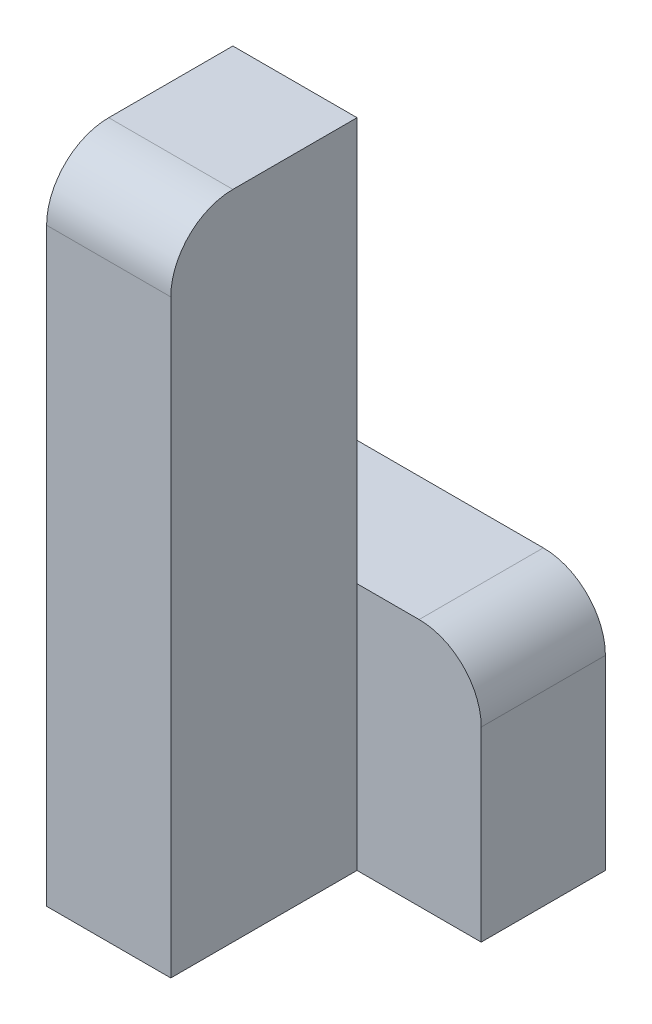
ISO-10303-21;
HEADER;
FILE_DESCRIPTION(('STEP AP214'),'2;1');
FILE_NAME('part.step','',(''),(''),'','','');
FILE_SCHEMA(('AUTOMOTIVE_DESIGN { 1 0 10303 214 1 1 1 1 }'));
ENDSEC;
DATA;
#1=APPLICATION_CONTEXT('core data for automotive mechanical design processes');
#2=APPLICATION_PROTOCOL_DEFINITION('international standard','automotive_design',2000,#1);
#3=PRODUCT_CONTEXT('',#1,'mechanical');
#4=PRODUCT('Part','Part','',(#3));
#5=PRODUCT_RELATED_PRODUCT_CATEGORY('part','',(#4));
#6=PRODUCT_DEFINITION_FORMATION('','',#4);
#7=PRODUCT_DEFINITION_CONTEXT('part definition',#1,'design');
#8=PRODUCT_DEFINITION('design','',#6,#7);
#9=PRODUCT_DEFINITION_SHAPE('','',#8);
#10=(LENGTH_UNIT() NAMED_UNIT(*) SI_UNIT(.MILLI.,.METRE.));
#11=(NAMED_UNIT(*) PLANE_ANGLE_UNIT() SI_UNIT($,.RADIAN.));
#12=(NAMED_UNIT(*) SI_UNIT($,.STERADIAN.) SOLID_ANGLE_UNIT());
#13=UNCERTAINTY_MEASURE_WITH_UNIT(LENGTH_MEASURE(1.E-05),#10,'distance_accuracy_value','');
#14=(GEOMETRIC_REPRESENTATION_CONTEXT(3) GLOBAL_UNCERTAINTY_ASSIGNED_CONTEXT((#13)) GLOBAL_UNIT_ASSIGNED_CONTEXT((#10,
#11,#12)) REPRESENTATION_CONTEXT('',''));
#15=CARTESIAN_POINT('',(0.,0.,0.));
#16=DIRECTION('',(0.,0.,1.));
#17=DIRECTION('',(1.,0.,0.));
#18=AXIS2_PLACEMENT_3D('',#15,#16,#17);
#19=CARTESIAN_POINT('',(-10.,0.,30.));
#20=DIRECTION('',(0.,-1.,0.));
#21=DIRECTION('',(1.,0.,0.));
#22=AXIS2_PLACEMENT_3D('',#19,#20,#21);
#23=PLANE('',#22);
#24=DIRECTION('',(0.,0.,-1.));
#25=VECTOR('',#24,1.);
#26=CARTESIAN_POINT('',(-30.,0.,30.));
#27=LINE('',#26,#25);
#28=CARTESIAN_POINT('',(-30.,0.,20.));
#29=VERTEX_POINT('',#28);
#30=CARTESIAN_POINT('',(-30.,0.,0.));
#31=VERTEX_POINT('',#30);
#32=EDGE_CURVE('E171',#29,#31,#27,.T.);
#33=ORIENTED_EDGE('',*,*,#32,.F.);
#34=DIRECTION('',(-1.,0.,0.));
#35=VECTOR('',#34,1.);
#36=CARTESIAN_POINT('',(-10.,0.,20.));
#37=LINE('',#36,#35);
#38=CARTESIAN_POINT('',(-10.,0.,20.));
#39=VERTEX_POINT('',#38);
#40=EDGE_CURVE('E43',#29,#39,#37,.F.);
#41=ORIENTED_EDGE('',*,*,#40,.T.);
#42=DIRECTION('',(0.,0.,-1.));
#43=VECTOR('',#42,1.);
#44=CARTESIAN_POINT('',(-10.,0.,30.));
#45=LINE('',#44,#43);
#46=CARTESIAN_POINT('',(-10.,0.,0.));
#47=VERTEX_POINT('',#46);
#48=EDGE_CURVE('E158',#39,#47,#45,.T.);
#49=ORIENTED_EDGE('',*,*,#48,.T.);
#50=DIRECTION('',(-1.,0.,0.));
#51=VECTOR('',#50,1.);
#52=CARTESIAN_POINT('',(-10.,0.,0.));
#53=LINE('',#52,#51);
#54=EDGE_CURVE('E148',#47,#31,#53,.T.);
#55=ORIENTED_EDGE('',*,*,#54,.T.);
#56=EDGE_LOOP('',(#33,#41,#49,#55));
#57=FACE_BOUND('',#56,.T.);
#58=ADVANCED_FACE('F35',(#57),#23,.F.);
#59=CARTESIAN_POINT('',(-30.,0.,30.));
#60=DIRECTION('',(1.,0.,0.));
#61=DIRECTION('',(0.,0.,-1.));
#62=AXIS2_PLACEMENT_3D('',#59,#60,#61);
#63=PLANE('',#62);
#64=DIRECTION('',(0.,-1.,0.));
#65=VECTOR('',#64,1.);
#66=CARTESIAN_POINT('',(-30.,0.,30.));
#67=LINE('',#66,#65);
#68=CARTESIAN_POINT('',(-30.,-10.,30.));
#69=VERTEX_POINT('',#68);
#70=CARTESIAN_POINT('',(-30.,-105.,30.));
#71=VERTEX_POINT('',#70);
#72=EDGE_CURVE('E150',#69,#71,#67,.T.);
#73=ORIENTED_EDGE('',*,*,#72,.F.);
#74=CARTESIAN_POINT('',(-30.,-10.,20.));
#75=DIRECTION('',(1.,0.,0.));
#76=DIRECTION('',(0.,0.,-1.));
#77=AXIS2_PLACEMENT_3D('',#74,#75,#76);
#78=CIRCLE('',#77,10.);
#79=EDGE_CURVE('E57',#69,#29,#78,.F.);
#80=ORIENTED_EDGE('',*,*,#79,.T.);
#81=ORIENTED_EDGE('',*,*,#32,.T.);
#82=DIRECTION('',(0.,-1.,0.));
#83=VECTOR('',#82,1.);
#84=CARTESIAN_POINT('',(-30.,0.,0.));
#85=LINE('',#84,#83);
#86=CARTESIAN_POINT('',(-30.,-65.,0.));
#87=VERTEX_POINT('',#86);
#88=EDGE_CURVE('E126',#31,#87,#85,.T.);
#89=ORIENTED_EDGE('',*,*,#88,.T.);
#90=DIRECTION('',(0.,0.,1.));
#91=VECTOR('',#90,1.);
#92=CARTESIAN_POINT('',(-30.,-65.,-20.));
#93=LINE('',#92,#91);
#94=CARTESIAN_POINT('',(-30.,-65.,-20.));
#95=VERTEX_POINT('',#94);
#96=EDGE_CURVE('E111',#95,#87,#93,.T.);
#97=ORIENTED_EDGE('',*,*,#96,.F.);
#98=DIRECTION('',(0.,-1.,0.));
#99=VECTOR('',#98,1.);
#100=CARTESIAN_POINT('',(-30.,-65.,-20.));
#101=LINE('',#100,#99);
#102=CARTESIAN_POINT('',(-30.,-105.,-20.));
#103=VERTEX_POINT('',#102);
#104=EDGE_CURVE('E118',#95,#103,#101,.T.);
#105=ORIENTED_EDGE('',*,*,#104,.T.);
#106=DIRECTION('',(0.,0.,-1.));
#107=VECTOR('',#106,1.);
#108=CARTESIAN_POINT('',(-30.,-105.,30.));
#109=LINE('',#108,#107);
#110=EDGE_CURVE('E169',#71,#103,#109,.T.);
#111=ORIENTED_EDGE('',*,*,#110,.F.);
#112=EDGE_LOOP('',(#73,#80,#81,#89,#97,#105,#111));
#113=FACE_BOUND('',#112,.T.);
#114=ADVANCED_FACE('F123',(#113),#63,.F.);
#115=CARTESIAN_POINT('',(-30.,-105.,30.));
#116=DIRECTION('',(0.,1.,0.));
#117=DIRECTION('',(0.,0.,1.));
#118=AXIS2_PLACEMENT_3D('',#115,#116,#117);
#119=PLANE('',#118);
#120=ORIENTED_EDGE('',*,*,#110,.T.);
#121=DIRECTION('',(1.,0.,0.));
#122=VECTOR('',#121,1.);
#123=CARTESIAN_POINT('',(-30.,-105.,-20.));
#124=LINE('',#123,#122);
#125=CARTESIAN_POINT('',(10.,-105.,-20.));
#126=VERTEX_POINT('',#125);
#127=EDGE_CURVE('E134',#103,#126,#124,.T.);
#128=ORIENTED_EDGE('',*,*,#127,.T.);
#129=DIRECTION('',(0.,0.,1.));
#130=VECTOR('',#129,1.);
#131=CARTESIAN_POINT('',(10.,-105.,-20.));
#132=LINE('',#131,#130);
#133=CARTESIAN_POINT('',(10.,-105.,0.));
#134=VERTEX_POINT('',#133);
#135=EDGE_CURVE('E127',#126,#134,#132,.T.);
#136=ORIENTED_EDGE('',*,*,#135,.T.);
#137=DIRECTION('',(1.,0.,0.));
#138=VECTOR('',#137,1.);
#139=CARTESIAN_POINT('',(-30.,-105.,0.));
#140=LINE('',#139,#138);
#141=CARTESIAN_POINT('',(-10.,-105.,0.));
#142=VERTEX_POINT('',#141);
#143=EDGE_CURVE('E142',#142,#134,#140,.T.);
#144=ORIENTED_EDGE('',*,*,#143,.F.);
#145=DIRECTION('',(0.,0.,-1.));
#146=VECTOR('',#145,1.);
#147=CARTESIAN_POINT('',(-10.,-105.,30.));
#148=LINE('',#147,#146);
#149=CARTESIAN_POINT('',(-10.,-105.,30.));
#150=VERTEX_POINT('',#149);
#151=EDGE_CURVE('E166',#150,#142,#148,.T.);
#152=ORIENTED_EDGE('',*,*,#151,.F.);
#153=DIRECTION('',(1.,0.,0.));
#154=VECTOR('',#153,1.);
#155=CARTESIAN_POINT('',(-30.,-105.,30.));
#156=LINE('',#155,#154);
#157=EDGE_CURVE('E152',#71,#150,#156,.T.);
#158=ORIENTED_EDGE('',*,*,#157,.F.);
#159=EDGE_LOOP('',(#120,#128,#136,#144,#152,#158));
#160=FACE_BOUND('',#159,.T.);
#161=ADVANCED_FACE('F193',(#160),#119,.F.);
#162=CARTESIAN_POINT('',(-10.,-105.,30.));
#163=DIRECTION('',(-1.,0.,0.));
#164=DIRECTION('',(0.,0.,1.));
#165=AXIS2_PLACEMENT_3D('',#162,#163,#164);
#166=PLANE('',#165);
#167=ORIENTED_EDGE('',*,*,#48,.F.);
#168=CARTESIAN_POINT('',(-10.,-10.,20.));
#169=DIRECTION('',(-1.,0.,0.));
#170=DIRECTION('',(0.,0.,1.));
#171=AXIS2_PLACEMENT_3D('',#168,#169,#170);
#172=CIRCLE('',#171,10.);
#173=CARTESIAN_POINT('',(-10.,-9.99999999999999,30.));
#174=VERTEX_POINT('',#173);
#175=EDGE_CURVE('E11',#39,#174,#172,.F.);
#176=ORIENTED_EDGE('',*,*,#175,.T.);
#177=DIRECTION('',(0.,1.,0.));
#178=VECTOR('',#177,1.);
#179=CARTESIAN_POINT('',(-10.,-105.,30.));
#180=LINE('',#179,#178);
#181=EDGE_CURVE('E155',#150,#174,#180,.T.);
#182=ORIENTED_EDGE('',*,*,#181,.F.);
#183=ORIENTED_EDGE('',*,*,#151,.T.);
#184=DIRECTION('',(0.,1.,0.));
#185=VECTOR('',#184,1.);
#186=CARTESIAN_POINT('',(-10.,-105.,0.));
#187=LINE('',#186,#185);
#188=CARTESIAN_POINT('',(-10.,-65.,0.));
#189=VERTEX_POINT('',#188);
#190=EDGE_CURVE('E153',#142,#189,#187,.T.);
#191=ORIENTED_EDGE('',*,*,#190,.T.);
#192=EDGE_CURVE('E162',#189,#47,#187,.T.);
#193=ORIENTED_EDGE('',*,*,#192,.T.);
#194=EDGE_LOOP('',(#167,#176,#182,#183,#191,#193));
#195=FACE_BOUND('',#194,.T.);
#196=ADVANCED_FACE('F196',(#195),#166,.F.);
#197=CARTESIAN_POINT('',(0.,0.,30.));
#198=DIRECTION('',(0.,0.,1.));
#199=DIRECTION('',(1.,0.,0.));
#200=AXIS2_PLACEMENT_3D('',#197,#198,#199);
#201=PLANE('',#200);
#202=ORIENTED_EDGE('',*,*,#181,.T.);
#203=DIRECTION('',(-1.,0.,0.));
#204=VECTOR('',#203,1.);
#205=CARTESIAN_POINT('',(-30.,-10.,30.));
#206=LINE('',#205,#204);
#207=EDGE_CURVE('E181',#174,#69,#206,.T.);
#208=ORIENTED_EDGE('',*,*,#207,.T.);
#209=ORIENTED_EDGE('',*,*,#72,.T.);
#210=ORIENTED_EDGE('',*,*,#157,.T.);
#211=EDGE_LOOP('',(#202,#208,#209,#210));
#212=FACE_BOUND('',#211,.T.);
#213=ADVANCED_FACE('F186',(#212),#201,.T.);
#214=CARTESIAN_POINT('',(0.,0.,0.));
#215=DIRECTION('',(0.,0.,1.));
#216=DIRECTION('',(1.,0.,0.));
#217=AXIS2_PLACEMENT_3D('',#214,#215,#216);
#218=PLANE('',#217);
#219=ORIENTED_EDGE('',*,*,#192,.F.);
#220=DIRECTION('',(-1.,0.,0.));
#221=VECTOR('',#220,1.);
#222=CARTESIAN_POINT('',(10.,-65.,0.));
#223=LINE('',#222,#221);
#224=EDGE_CURVE('E143',#189,#87,#223,.T.);
#225=ORIENTED_EDGE('',*,*,#224,.T.);
#226=ORIENTED_EDGE('',*,*,#88,.F.);
#227=ORIENTED_EDGE('',*,*,#54,.F.);
#228=EDGE_LOOP('',(#219,#225,#226,#227));
#229=FACE_BOUND('',#228,.T.);
#230=ADVANCED_FACE('F215',(#229),#218,.F.);
#231=CARTESIAN_POINT('',(0.,0.,0.));
#232=DIRECTION('',(0.,0.,1.));
#233=DIRECTION('',(1.,0.,0.));
#234=AXIS2_PLACEMENT_3D('',#231,#232,#233);
#235=PLANE('',#234);
#236=DIRECTION('',(0.,1.,0.));
#237=VECTOR('',#236,1.);
#238=CARTESIAN_POINT('',(10.,-105.,0.));
#239=LINE('',#238,#237);
#240=CARTESIAN_POINT('',(10.,-75.,0.));
#241=VERTEX_POINT('',#240);
#242=EDGE_CURVE('E119',#134,#241,#239,.T.);
#243=ORIENTED_EDGE('',*,*,#242,.T.);
#244=CARTESIAN_POINT('',(0.,-75.,0.));
#245=DIRECTION('',(0.,0.,1.));
#246=DIRECTION('',(1.,0.,0.));
#247=AXIS2_PLACEMENT_3D('',#244,#245,#246);
#248=CIRCLE('',#247,10.);
#249=CARTESIAN_POINT('',(0.,-65.,0.));
#250=VERTEX_POINT('',#249);
#251=EDGE_CURVE('E176',#241,#250,#248,.T.);
#252=ORIENTED_EDGE('',*,*,#251,.T.);
#253=EDGE_CURVE('E140',#250,#189,#223,.T.);
#254=ORIENTED_EDGE('',*,*,#253,.T.);
#255=ORIENTED_EDGE('',*,*,#190,.F.);
#256=ORIENTED_EDGE('',*,*,#143,.T.);
#257=EDGE_LOOP('',(#243,#252,#254,#255,#256));
#258=FACE_BOUND('',#257,.T.);
#259=ADVANCED_FACE('F218',(#258),#235,.T.);
#260=CARTESIAN_POINT('',(10.,-65.,-20.));
#261=DIRECTION('',(0.,1.,0.));
#262=DIRECTION('',(0.,0.,1.));
#263=AXIS2_PLACEMENT_3D('',#260,#261,#262);
#264=PLANE('',#263);
#265=ORIENTED_EDGE('',*,*,#253,.F.);
#266=DIRECTION('',(0.,0.,1.));
#267=VECTOR('',#266,1.);
#268=CARTESIAN_POINT('',(0.,-65.,-20.));
#269=LINE('',#268,#267);
#270=CARTESIAN_POINT('',(0.,-65.,-20.));
#271=VERTEX_POINT('',#270);
#272=EDGE_CURVE('E114',#250,#271,#269,.F.);
#273=ORIENTED_EDGE('',*,*,#272,.T.);
#274=DIRECTION('',(-1.,0.,0.));
#275=VECTOR('',#274,1.);
#276=CARTESIAN_POINT('',(10.,-65.,-20.));
#277=LINE('',#276,#275);
#278=EDGE_CURVE('E106',#271,#95,#277,.T.);
#279=ORIENTED_EDGE('',*,*,#278,.T.);
#280=ORIENTED_EDGE('',*,*,#96,.T.);
#281=ORIENTED_EDGE('',*,*,#224,.F.);
#282=EDGE_LOOP('',(#265,#273,#279,#280,#281));
#283=FACE_BOUND('',#282,.T.);
#284=ADVANCED_FACE('F109',(#283),#264,.T.);
#285=CARTESIAN_POINT('',(10.,-105.,-20.));
#286=DIRECTION('',(1.,0.,0.));
#287=DIRECTION('',(0.,0.,-1.));
#288=AXIS2_PLACEMENT_3D('',#285,#286,#287);
#289=PLANE('',#288);
#290=DIRECTION('',(0.,1.,0.));
#291=VECTOR('',#290,1.);
#292=CARTESIAN_POINT('',(10.,-105.,-20.));
#293=LINE('',#292,#291);
#294=CARTESIAN_POINT('',(10.,-75.,-20.));
#295=VERTEX_POINT('',#294);
#296=EDGE_CURVE('E128',#126,#295,#293,.T.);
#297=ORIENTED_EDGE('',*,*,#296,.T.);
#298=DIRECTION('',(0.,0.,1.));
#299=VECTOR('',#298,1.);
#300=CARTESIAN_POINT('',(10.,-75.,-20.));
#301=LINE('',#300,#299);
#302=EDGE_CURVE('E173',#295,#241,#301,.T.);
#303=ORIENTED_EDGE('',*,*,#302,.T.);
#304=ORIENTED_EDGE('',*,*,#242,.F.);
#305=ORIENTED_EDGE('',*,*,#135,.F.);
#306=EDGE_LOOP('',(#297,#303,#304,#305));
#307=FACE_BOUND('',#306,.T.);
#308=ADVANCED_FACE('F224',(#307),#289,.T.);
#309=CARTESIAN_POINT('',(0.,0.,-20.));
#310=DIRECTION('',(0.,0.,1.));
#311=DIRECTION('',(1.,0.,0.));
#312=AXIS2_PLACEMENT_3D('',#309,#310,#311);
#313=PLANE('',#312);
#314=ORIENTED_EDGE('',*,*,#278,.F.);
#315=CARTESIAN_POINT('',(0.,-75.,-20.));
#316=DIRECTION('',(0.,0.,1.));
#317=DIRECTION('',(1.,0.,0.));
#318=AXIS2_PLACEMENT_3D('',#315,#316,#317);
#319=CIRCLE('',#318,10.);
#320=EDGE_CURVE('E179',#271,#295,#319,.F.);
#321=ORIENTED_EDGE('',*,*,#320,.T.);
#322=ORIENTED_EDGE('',*,*,#296,.F.);
#323=ORIENTED_EDGE('',*,*,#127,.F.);
#324=ORIENTED_EDGE('',*,*,#104,.F.);
#325=EDGE_LOOP('',(#314,#321,#322,#323,#324));
#326=FACE_BOUND('',#325,.T.);
#327=ADVANCED_FACE('F131',(#326),#313,.F.);
#328=CARTESIAN_POINT('',(0.,-75.,-20.));
#329=DIRECTION('',(0.,0.,1.));
#330=DIRECTION('',(1.,0.,0.));
#331=AXIS2_PLACEMENT_3D('',#328,#329,#330);
#332=CYLINDRICAL_SURFACE('',#331,10.);
#333=ORIENTED_EDGE('',*,*,#320,.F.);
#334=ORIENTED_EDGE('',*,*,#272,.F.);
#335=ORIENTED_EDGE('',*,*,#251,.F.);
#336=ORIENTED_EDGE('',*,*,#302,.F.);
#337=EDGE_LOOP('',(#333,#334,#335,#336));
#338=FACE_BOUND('',#337,.T.);
#339=ADVANCED_FACE('F199',(#338),#332,.T.);
#340=CARTESIAN_POINT('',(0.,-10.,20.));
#341=DIRECTION('',(1.,0.,0.));
#342=DIRECTION('',(0.,1.,0.));
#343=AXIS2_PLACEMENT_3D('',#340,#341,#342);
#344=CYLINDRICAL_SURFACE('',#343,10.);
#345=ORIENTED_EDGE('',*,*,#175,.F.);
#346=ORIENTED_EDGE('',*,*,#40,.F.);
#347=ORIENTED_EDGE('',*,*,#79,.F.);
#348=ORIENTED_EDGE('',*,*,#207,.F.);
#349=EDGE_LOOP('',(#345,#346,#347,#348));
#350=FACE_BOUND('',#349,.T.);
#351=ADVANCED_FACE('F37',(#350),#344,.T.);
#352=CLOSED_SHELL('',(#58,#114,#161,#196,#213,#230,#259,#284,#308,#327,#339,#351));
#353=MANIFOLD_SOLID_BREP('B2',#352);
#354=ADVANCED_BREP_SHAPE_REPRESENTATION('',(#18,#353),#14);
#355=SHAPE_DEFINITION_REPRESENTATION(#9,#354);
ENDSEC;
END-ISO-10303-21;
